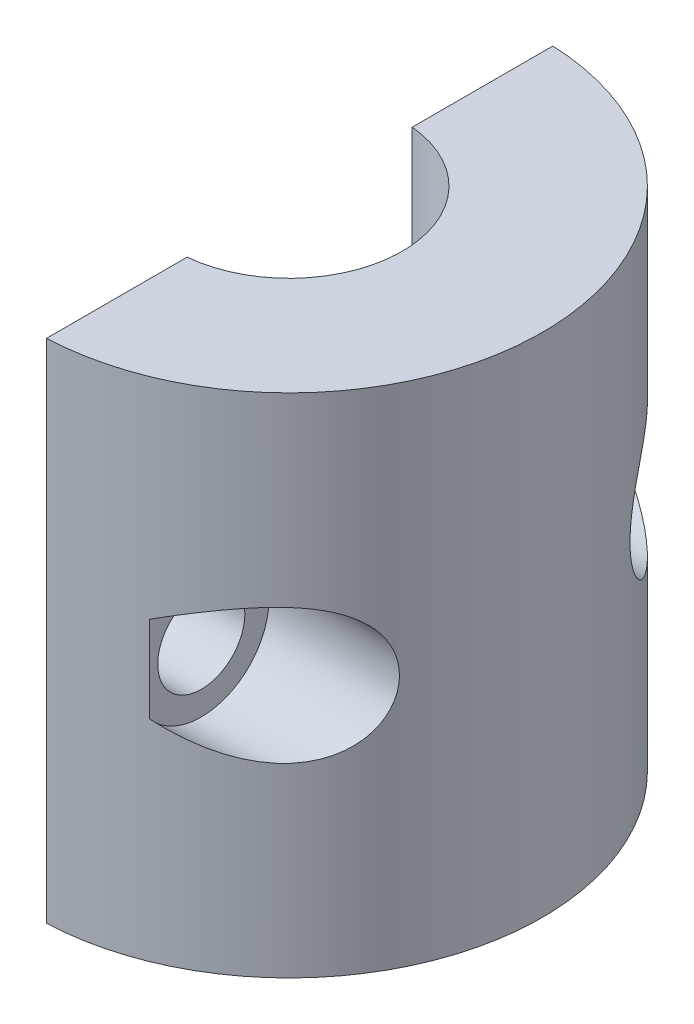
ISO-10303-21;
HEADER;
FILE_DESCRIPTION(('STEP AP214'),'2;1');
FILE_NAME('part.step','',(''),(''),'','','');
FILE_SCHEMA(('AUTOMOTIVE_DESIGN { 1 0 10303 214 1 1 1 1 }'));
ENDSEC;
DATA;
#1=APPLICATION_CONTEXT('core data for automotive mechanical design processes');
#2=APPLICATION_PROTOCOL_DEFINITION('international standard','automotive_design',2000,#1);
#3=PRODUCT_CONTEXT('',#1,'mechanical');
#4=PRODUCT('Part','Part','',(#3));
#5=PRODUCT_RELATED_PRODUCT_CATEGORY('part','',(#4));
#6=PRODUCT_DEFINITION_FORMATION('','',#4);
#7=PRODUCT_DEFINITION_CONTEXT('part definition',#1,'design');
#8=PRODUCT_DEFINITION('design','',#6,#7);
#9=PRODUCT_DEFINITION_SHAPE('','',#8);
#10=(LENGTH_UNIT() NAMED_UNIT(*) SI_UNIT(.MILLI.,.METRE.));
#11=(NAMED_UNIT(*) PLANE_ANGLE_UNIT() SI_UNIT($,.RADIAN.));
#12=(NAMED_UNIT(*) SI_UNIT($,.STERADIAN.) SOLID_ANGLE_UNIT());
#13=UNCERTAINTY_MEASURE_WITH_UNIT(LENGTH_MEASURE(1.E-05),#10,'distance_accuracy_value','');
#14=(GEOMETRIC_REPRESENTATION_CONTEXT(3) GLOBAL_UNCERTAINTY_ASSIGNED_CONTEXT((#13)) GLOBAL_UNIT_ASSIGNED_CONTEXT((#10,
#11,#12)) REPRESENTATION_CONTEXT('',''));
#15=CARTESIAN_POINT('',(0.,0.,0.));
#16=DIRECTION('',(0.,0.,1.));
#17=DIRECTION('',(1.,0.,0.));
#18=AXIS2_PLACEMENT_3D('',#15,#16,#17);
#19=CARTESIAN_POINT('',(0.,19.05,0.));
#20=DIRECTION('',(0.,-1.,0.));
#21=DIRECTION('',(0.,0.,-1.));
#22=AXIS2_PLACEMENT_3D('',#19,#20,#21);
#23=CYLINDRICAL_SURFACE('',#22,9.525);
#24=DIRECTION('',(0.,-1.,0.));
#25=VECTOR('',#24,1.);
#26=CARTESIAN_POINT('',(3.571875,19.05,-8.82991132369827));
#27=LINE('',#26,#25);
#28=CARTESIAN_POINT('',(3.571875,7.90440811715349,-8.82991132369827));
#29=VERTEX_POINT('',#28);
#30=CARTESIAN_POINT('',(3.571875,11.1455918828465,-8.82991132369827));
#31=VERTEX_POINT('',#30);
#32=EDGE_CURVE('E51',#29,#31,#27,.F.);
#33=ORIENTED_EDGE('',*,*,#32,.F.);
#34=CARTESIAN_POINT('',(3.571875,7.9044081171535,-8.82991132369827));
#35=CARTESIAN_POINT('',(3.66209979232473,7.86037056232318,-8.79341345418695));
#36=CARTESIAN_POINT('',(3.7522238570905,7.81744725893768,-8.75534722987873));
#37=CARTESIAN_POINT('',(3.93216628934824,7.73393231878488,-8.67602242601452));
#38=CARTESIAN_POINT('',(4.02198460569287,7.69334105568242,-8.63476333733503));
#39=CARTESIAN_POINT('',(4.2912500306122,7.57503477443256,-8.50590719981016));
#40=CARTESIAN_POINT('',(4.47003426837349,7.50101887483413,-8.41342169051201));
#41=CARTESIAN_POINT('',(4.82699568649797,7.36367012453673,-8.21389744439114));
#42=CARTESIAN_POINT('',(5.00513412907924,7.30049017200264,-8.10668369311737));
#43=CARTESIAN_POINT('',(5.35697382785832,7.18862449653994,-7.8785976275317));
#44=CARTESIAN_POINT('',(5.53068059087369,7.13991989529101,-7.75774338924852));
#45=CARTESIAN_POINT('',(5.79920062410466,7.07736317525379,-7.55710398609687));
#46=CARTESIAN_POINT('',(5.89601696004026,7.05751053906295,-7.48182889904772));
#47=CARTESIAN_POINT('',(6.08736154343368,7.0244521402183,-7.32699075824522));
#48=CARTESIAN_POINT('',(6.18188974558876,7.01124650906621,-7.24742761969324));
#49=CARTESIAN_POINT('',(6.3678760006043,6.99241407341539,-7.08456037835332));
#50=CARTESIAN_POINT('',(6.45934383734736,6.98676029264535,-7.00127069560271));
#51=CARTESIAN_POINT('',(6.63901028383844,6.98393846426453,-6.83114121656956));
#52=CARTESIAN_POINT('',(6.72720959660493,6.98676858102326,-6.74430219225551));
#53=CARTESIAN_POINT('',(6.95163711622552,7.00657082339006,-6.5145459668544));
#54=CARTESIAN_POINT('',(7.08492100436795,7.03101115241624,-6.36925215301089));
#55=CARTESIAN_POINT('',(7.33861669215024,7.10912945487307,-6.07518678831957));
#56=CARTESIAN_POINT('',(7.45904098540909,7.1627787357347,-5.92641878727621));
#57=CARTESIAN_POINT('',(7.66056583113011,7.28886389790973,-5.66242827597344));
#58=CARTESIAN_POINT('',(7.7446651177257,7.35518661747376,-5.54658583071506));
#59=CARTESIAN_POINT('',(7.90093013756525,7.51004718379886,-5.32161775390467));
#60=CARTESIAN_POINT('',(7.97310027730938,7.59857679700967,-5.21248965153888));
#61=CARTESIAN_POINT('',(8.07144112995407,7.74794190059528,-5.05779482070129));
#62=CARTESIAN_POINT('',(8.10267750690789,7.80074562427919,-5.00754025219411));
#63=CARTESIAN_POINT('',(8.16159612794626,7.91161425719849,-4.91092248891653));
#64=CARTESIAN_POINT('',(8.18928012296526,7.96967655027599,-4.86455738100133));
#65=CARTESIAN_POINT('',(8.24098340530796,8.09072710215563,-4.7764456990709));
#66=CARTESIAN_POINT('',(8.26500309791077,8.15371481502928,-4.73469861443373));
#67=CARTESIAN_POINT('',(8.30930198435181,8.28411132903954,-4.65651595251313));
#68=CARTESIAN_POINT('',(8.32958169814648,8.35151951384399,-4.62007963703956));
#69=CARTESIAN_POINT('',(8.38025636503462,8.54263631270502,-4.52785286145473));
#70=CARTESIAN_POINT('',(8.40674170571834,8.67045694811874,-4.47819645802342));
#71=CARTESIAN_POINT('',(8.44796513576629,8.93409256903768,-4.39994283518333));
#72=CARTESIAN_POINT('',(8.46270825963465,9.06990410157538,-4.37133659086811));
#73=CARTESIAN_POINT('',(8.47991385430998,9.3356260314963,-4.33785734701318));
#74=CARTESIAN_POINT('',(8.48315214899674,9.46529869666096,-4.3314855532077));
#75=CARTESIAN_POINT('',(8.47952637859391,9.72393893831676,-4.33858002956364));
#76=CARTESIAN_POINT('',(8.47266434722201,9.85290665150347,-4.35204230610208));
#77=CARTESIAN_POINT('',(8.44900900673009,10.1043421374019,-4.39778463763018));
#78=CARTESIAN_POINT('',(8.43237694537401,10.226881031059,-4.42975904181945));
#79=CARTESIAN_POINT('',(8.38929589942858,10.4643146894415,-4.51081268185751));
#80=CARTESIAN_POINT('',(8.36284699468864,10.5792095163343,-4.55989177857791));
#81=CARTESIAN_POINT('',(8.29963726107557,10.8004904664468,-4.67396543324807));
#82=CARTESIAN_POINT('',(8.26269872086899,10.9066853063611,-4.73923157479821));
#83=CARTESIAN_POINT('',(8.17899572442347,11.1059263800129,-4.88226434844604));
#84=CARTESIAN_POINT('',(8.13222968731193,11.1989704942634,-4.96003299124988));
#85=CARTESIAN_POINT('',(8.02623908029295,11.3757607768071,-5.12988371179305));
#86=CARTESIAN_POINT('',(7.9664274341932,11.4585901155477,-5.22255033256562));
#87=CARTESIAN_POINT('',(7.83723106699825,11.6073065759743,-5.41450179650204));
#88=CARTESIAN_POINT('',(7.7678426566729,11.6731871403843,-5.51378918250957));
#89=CARTESIAN_POINT('',(7.61126450183015,11.7956947343135,-5.72835504562769));
#90=CARTESIAN_POINT('',(7.52293320980239,11.8500914109786,-5.84406561850468));
#91=CARTESIAN_POINT('',(7.33717280398961,11.9394467264164,-6.07565540554215));
#92=CARTESIAN_POINT('',(7.23973823160107,11.9743936140019,-6.1915346793352));
#93=CARTESIAN_POINT('',(7.0588217417664,12.0213893319124,-6.39634448186829));
#94=CARTESIAN_POINT('',(6.97674005478672,12.0367156854936,-6.48579699618851));
#95=CARTESIAN_POINT('',(6.80858689613985,12.0576961598884,-6.66210248826432));
#96=CARTESIAN_POINT('',(6.72251362821212,12.0633458818549,-6.74895426614882));
#97=CARTESIAN_POINT('',(6.54685383824359,12.0660286877278,-6.91949067564383));
#98=CARTESIAN_POINT('',(6.45726059221878,12.0630444018469,-7.00316857919901));
#99=CARTESIAN_POINT('',(6.27522832387629,12.0494182516178,-7.16673706650566));
#100=CARTESIAN_POINT('',(6.18278843201944,12.0387740247957,-7.2466264737071));
#101=CARTESIAN_POINT('',(5.95249626405013,12.0042819148774,-7.43807578984856));
#102=CARTESIAN_POINT('',(5.813288412395,11.9766149278798,-7.54732714778011));
#103=CARTESIAN_POINT('',(5.53090627518268,11.9092738966945,-7.7566509928859));
#104=CARTESIAN_POINT('',(5.3877298926231,11.869593390193,-7.85671850203609));
#105=CARTESIAN_POINT('',(5.09823572691922,11.7801252340329,-8.04758987801269));
#106=CARTESIAN_POINT('',(4.95191528655061,11.7303287080757,-8.13838550335866));
#107=CARTESIAN_POINT('',(4.65705396310569,11.6221993092512,-8.31063300718546));
#108=CARTESIAN_POINT('',(4.5085138955413,11.5638695055627,-8.39208822643472));
#109=CARTESIAN_POINT('',(4.22860225085846,11.4476379035625,-8.53616474207564));
#110=CARTESIAN_POINT('',(4.09742127899583,11.3906051286734,-8.5998662929286));
#111=CARTESIAN_POINT('',(3.83485030637796,11.2716670159615,-8.72010968403709));
#112=CARTESIAN_POINT('',(3.70346412348701,11.2097856043424,-8.77668348281964));
#113=CARTESIAN_POINT('',(3.571875,11.1455918828465,-8.82991132369827));
#114=B_SPLINE_CURVE_WITH_KNOTS('',3,(#34,#35,#36,#37,#38,#39,#40,#41,#42,#43,#44,#45,#46,#47,
#48,#49,#50,#51,#52,#53,#54,#55,#56,#57,#58,#59,#60,#61,#62,#63,#64,#65,#66,#67,#68,#69,#70,#71,
#72,#73,#74,#75,#76,#77,#78,#79,#80,#81,#82,#83,#84,#85,#86,#87,#88,#89,#90,#91,#92,#93,#94,#95,
#96,#97,#98,#99,#100,#101,#102,#103,#104,#105,#106,#107,#108,#109,#110,#111,#112,#113),
.UNSPECIFIED.,.F.,.F.,(4,2,2,2,2,2,2,2,2,2,2,2,2,2,2,2,2,2,2,2,2,2,2,2,2,2,2,2,2,2,2,2,2,2,2,2,
2,2,2,4),(0.,0.320442777941843,0.640936758326895,1.28360142733641,1.93469764712494,
2.58494096255242,2.95741176413708,3.3298899342469,3.70103396956778,4.07209770758108,
4.66586323288177,5.25904653941032,5.73052114953232,6.20182121084317,6.43944778259307,
6.67695677691611,6.914439483198,7.15188914814201,7.56845891322877,7.98484997671861,
8.37256487527391,8.76020171745891,9.14161381594876,9.5230228121315,9.91132432098561,
10.2996883407487,10.7118071721318,11.1240852083429,11.5886045363862,12.0534042142146,
12.4200224963301,12.7868073932551,13.1543306961564,13.5219673989575,14.0584739462024,
14.5952696054324,15.1325383262481,15.6696142796304,16.1391351246827,16.6064696048172),.UNSPECIFIED.);
#115=EDGE_CURVE('E11',#29,#31,#114,.T.);
#116=ORIENTED_EDGE('',*,*,#115,.T.);
#117=EDGE_LOOP('',(#33,#116));
#118=FACE_BOUND('',#117,.T.);
#119=CARTESIAN_POINT('',(0.,0.,0.));
#120=DIRECTION('',(0.,1.,0.));
#121=DIRECTION('',(0.,0.,1.));
#122=AXIS2_PLACEMENT_3D('',#119,#120,#121);
#123=CIRCLE('',#122,9.525);
#124=CARTESIAN_POINT('',(0.396875000000001,0.,9.51672817907368));
#125=VERTEX_POINT('',#124);
#126=CARTESIAN_POINT('',(0.396875000000001,0.,-9.51672817907368));
#127=VERTEX_POINT('',#126);
#128=EDGE_CURVE('E108',#125,#127,#123,.T.);
#129=ORIENTED_EDGE('',*,*,#128,.T.);
#130=DIRECTION('',(0.,-1.,0.));
#131=VECTOR('',#130,1.);
#132=CARTESIAN_POINT('',(0.396875000000001,19.05,-9.51672817907368));
#133=LINE('',#132,#131);
#134=CARTESIAN_POINT('',(0.396875000000001,19.05,-9.51672817907368));
#135=VERTEX_POINT('',#134);
#136=EDGE_CURVE('E162',#135,#127,#133,.T.);
#137=ORIENTED_EDGE('',*,*,#136,.F.);
#138=CARTESIAN_POINT('',(0.,19.05,0.));
#139=DIRECTION('',(0.,1.,0.));
#140=DIRECTION('',(0.,0.,1.));
#141=AXIS2_PLACEMENT_3D('',#138,#139,#140);
#142=CIRCLE('',#141,9.525);
#143=CARTESIAN_POINT('',(0.396875000000001,19.05,9.51672817907368));
#144=VERTEX_POINT('',#143);
#145=EDGE_CURVE('E191',#144,#135,#142,.T.);
#146=ORIENTED_EDGE('',*,*,#145,.F.);
#147=DIRECTION('',(0.,-1.,0.));
#148=VECTOR('',#147,1.);
#149=CARTESIAN_POINT('',(0.396875000000001,19.05,9.51672817907368));
#150=LINE('',#149,#148);
#151=EDGE_CURVE('E186',#144,#125,#150,.T.);
#152=ORIENTED_EDGE('',*,*,#151,.T.);
#153=EDGE_LOOP('',(#129,#137,#146,#152));
#154=FACE_BOUND('',#153,.T.);
#155=CARTESIAN_POINT('',(3.571875,7.9044081171535,8.82991132369827));
#156=CARTESIAN_POINT('',(3.66209979232473,7.86037056232318,8.79341345418695));
#157=CARTESIAN_POINT('',(3.7522238570905,7.81744725893768,8.75534722987873));
#158=CARTESIAN_POINT('',(3.93216628934824,7.73393231878488,8.67602242601452));
#159=CARTESIAN_POINT('',(4.02198460569287,7.69334105568242,8.63476333733503));
#160=CARTESIAN_POINT('',(4.2912500306122,7.57503477443256,8.50590719981016));
#161=CARTESIAN_POINT('',(4.47003426837349,7.50101887483413,8.41342169051201));
#162=CARTESIAN_POINT('',(4.82699568649797,7.36367012453673,8.21389744439114));
#163=CARTESIAN_POINT('',(5.00513412907924,7.30049017200264,8.10668369311737));
#164=CARTESIAN_POINT('',(5.35697382785832,7.18862449653994,7.8785976275317));
#165=CARTESIAN_POINT('',(5.53068059087369,7.13991989529101,7.75774338924852));
#166=CARTESIAN_POINT('',(5.79920062410466,7.07736317525379,7.55710398609687));
#167=CARTESIAN_POINT('',(5.89601696004026,7.05751053906295,7.48182889904772));
#168=CARTESIAN_POINT('',(6.08736154343368,7.0244521402183,7.32699075824522));
#169=CARTESIAN_POINT('',(6.18188974558876,7.01124650906621,7.24742761969324));
#170=CARTESIAN_POINT('',(6.3678760006043,6.99241407341539,7.08456037835332));
#171=CARTESIAN_POINT('',(6.45934383734736,6.98676029264535,7.00127069560271));
#172=CARTESIAN_POINT('',(6.63901028383844,6.98393846426453,6.83114121656956));
#173=CARTESIAN_POINT('',(6.72720959660493,6.98676858102326,6.74430219225551));
#174=CARTESIAN_POINT('',(6.95163711622552,7.00657082339006,6.5145459668544));
#175=CARTESIAN_POINT('',(7.08492100436795,7.03101115241624,6.36925215301089));
#176=CARTESIAN_POINT('',(7.33861669215024,7.10912945487307,6.07518678831957));
#177=CARTESIAN_POINT('',(7.45904098540909,7.1627787357347,5.92641878727621));
#178=CARTESIAN_POINT('',(7.66056583113011,7.28886389790973,5.66242827597344));
#179=CARTESIAN_POINT('',(7.7446651177257,7.35518661747376,5.54658583071506));
#180=CARTESIAN_POINT('',(7.90093013756525,7.51004718379886,5.32161775390467));
#181=CARTESIAN_POINT('',(7.97310027730938,7.59857679700967,5.21248965153888));
#182=CARTESIAN_POINT('',(8.07144112995407,7.74794190059528,5.05779482070129));
#183=CARTESIAN_POINT('',(8.10267750690789,7.80074562427919,5.00754025219411));
#184=CARTESIAN_POINT('',(8.16159612794626,7.91161425719849,4.91092248891653));
#185=CARTESIAN_POINT('',(8.18928012296526,7.96967655027599,4.86455738100133));
#186=CARTESIAN_POINT('',(8.24098340530796,8.09072710215563,4.7764456990709));
#187=CARTESIAN_POINT('',(8.26500309791077,8.15371481502928,4.73469861443373));
#188=CARTESIAN_POINT('',(8.30930198435181,8.28411132903954,4.65651595251313));
#189=CARTESIAN_POINT('',(8.32958169814648,8.35151951384399,4.62007963703956));
#190=CARTESIAN_POINT('',(8.38025636503462,8.54263631270502,4.52785286145473));
#191=CARTESIAN_POINT('',(8.40674170571834,8.67045694811874,4.47819645802342));
#192=CARTESIAN_POINT('',(8.44796513576629,8.93409256903768,4.39994283518333));
#193=CARTESIAN_POINT('',(8.46270825963465,9.06990410157538,4.37133659086811));
#194=CARTESIAN_POINT('',(8.47991385430998,9.3356260314963,4.33785734701318));
#195=CARTESIAN_POINT('',(8.48315214899674,9.46529869666096,4.3314855532077));
#196=CARTESIAN_POINT('',(8.47952637859391,9.72393893831676,4.33858002956364));
#197=CARTESIAN_POINT('',(8.47266434722201,9.85290665150347,4.35204230610208));
#198=CARTESIAN_POINT('',(8.44900900673009,10.1043421374019,4.39778463763018));
#199=CARTESIAN_POINT('',(8.43237694537401,10.226881031059,4.42975904181945));
#200=CARTESIAN_POINT('',(8.38929589942858,10.4643146894415,4.51081268185751));
#201=CARTESIAN_POINT('',(8.36284699468864,10.5792095163343,4.55989177857791));
#202=CARTESIAN_POINT('',(8.29963726107557,10.8004904664468,4.67396543324807));
#203=CARTESIAN_POINT('',(8.26269872086899,10.9066853063611,4.73923157479821));
#204=CARTESIAN_POINT('',(8.17899572442347,11.1059263800129,4.88226434844604));
#205=CARTESIAN_POINT('',(8.13222968731193,11.1989704942634,4.96003299124988));
#206=CARTESIAN_POINT('',(8.02623908029295,11.3757607768071,5.12988371179305));
#207=CARTESIAN_POINT('',(7.9664274341932,11.4585901155477,5.22255033256562));
#208=CARTESIAN_POINT('',(7.83723106699825,11.6073065759743,5.41450179650204));
#209=CARTESIAN_POINT('',(7.7678426566729,11.6731871403843,5.51378918250957));
#210=CARTESIAN_POINT('',(7.61126450183015,11.7956947343135,5.72835504562769));
#211=CARTESIAN_POINT('',(7.52293320980239,11.8500914109786,5.84406561850468));
#212=CARTESIAN_POINT('',(7.33717280398961,11.9394467264164,6.07565540554215));
#213=CARTESIAN_POINT('',(7.23973823160107,11.9743936140019,6.1915346793352));
#214=CARTESIAN_POINT('',(7.0588217417664,12.0213893319124,6.39634448186829));
#215=CARTESIAN_POINT('',(6.97674005478672,12.0367156854936,6.48579699618851));
#216=CARTESIAN_POINT('',(6.80858689613985,12.0576961598884,6.66210248826432));
#217=CARTESIAN_POINT('',(6.72251362821212,12.0633458818549,6.74895426614882));
#218=CARTESIAN_POINT('',(6.54685383824359,12.0660286877278,6.91949067564383));
#219=CARTESIAN_POINT('',(6.45726059221878,12.0630444018469,7.00316857919901));
#220=CARTESIAN_POINT('',(6.27522832387629,12.0494182516178,7.16673706650566));
#221=CARTESIAN_POINT('',(6.18278843201944,12.0387740247957,7.2466264737071));
#222=CARTESIAN_POINT('',(5.95249626405013,12.0042819148774,7.43807578984856));
#223=CARTESIAN_POINT('',(5.813288412395,11.9766149278798,7.54732714778011));
#224=CARTESIAN_POINT('',(5.53090627518268,11.9092738966945,7.7566509928859));
#225=CARTESIAN_POINT('',(5.3877298926231,11.869593390193,7.85671850203609));
#226=CARTESIAN_POINT('',(5.09823572691922,11.7801252340329,8.04758987801269));
#227=CARTESIAN_POINT('',(4.95191528655061,11.7303287080757,8.13838550335866));
#228=CARTESIAN_POINT('',(4.65705396310569,11.6221993092512,8.31063300718546));
#229=CARTESIAN_POINT('',(4.5085138955413,11.5638695055627,8.39208822643472));
#230=CARTESIAN_POINT('',(4.22860225085846,11.4476379035625,8.53616474207564));
#231=CARTESIAN_POINT('',(4.09742127899583,11.3906051286734,8.5998662929286));
#232=CARTESIAN_POINT('',(3.83485030637796,11.2716670159615,8.72010968403709));
#233=CARTESIAN_POINT('',(3.70346412348701,11.2097856043424,8.77668348281964));
#234=CARTESIAN_POINT('',(3.571875,11.1455918828465,8.82991132369827));
#235=B_SPLINE_CURVE_WITH_KNOTS('',3,(#155,#156,#157,#158,#159,#160,#161,#162,#163,#164,#165,
#166,#167,#168,#169,#170,#171,#172,#173,#174,#175,#176,#177,#178,#179,#180,#181,#182,#183,#184,
#185,#186,#187,#188,#189,#190,#191,#192,#193,#194,#195,#196,#197,#198,#199,#200,#201,#202,#203,
#204,#205,#206,#207,#208,#209,#210,#211,#212,#213,#214,#215,#216,#217,#218,#219,#220,#221,#222,
#223,#224,#225,#226,#227,#228,#229,#230,#231,#232,#233,#234),.UNSPECIFIED.,.F.,.F.,(4,2,2,2,2,2,
2,2,2,2,2,2,2,2,2,2,2,2,2,2,2,2,2,2,2,2,2,2,2,2,2,2,2,2,2,2,2,2,2,4),(0.,0.320442777941843,
0.640936758326895,1.28360142733641,1.93469764712494,2.58494096255242,2.95741176413708,
3.3298899342469,3.70103396956778,4.07209770758108,4.66586323288177,5.25904653941032,
5.73052114953232,6.20182121084317,6.43944778259307,6.67695677691611,6.914439483198,
7.15188914814201,7.56845891322877,7.98484997671861,8.37256487527391,8.76020171745891,
9.14161381594876,9.5230228121315,9.91132432098561,10.2996883407487,10.7118071721318,
11.1240852083429,11.5886045363862,12.0534042142146,12.4200224963301,12.7868073932551,
13.1543306961564,13.5219673989575,14.0584739462024,14.5952696054324,15.1325383262481,
15.6696142796304,16.1391351246827,16.6064696048172),.UNSPECIFIED.);
#236=CARTESIAN_POINT('',(3.571875,7.90440811715349,8.82991132369827));
#237=VERTEX_POINT('',#236);
#238=CARTESIAN_POINT('',(3.571875,11.1455918828465,8.82991132369827));
#239=VERTEX_POINT('',#238);
#240=EDGE_CURVE('E97',#237,#239,#235,.T.);
#241=ORIENTED_EDGE('',*,*,#240,.F.);
#242=DIRECTION('',(0.,-1.,0.));
#243=VECTOR('',#242,1.);
#244=CARTESIAN_POINT('',(3.571875,19.05,8.82991132369827));
#245=LINE('',#244,#243);
#246=EDGE_CURVE('E112',#239,#237,#245,.T.);
#247=ORIENTED_EDGE('',*,*,#246,.F.);
#248=EDGE_LOOP('',(#241,#247));
#249=FACE_BOUND('',#248,.T.);
#250=ADVANCED_FACE('F37',(#118,#154,#249),#23,.T.);
#251=CARTESIAN_POINT('',(0.,19.05,0.));
#252=DIRECTION('',(0.,-1.,0.));
#253=DIRECTION('',(0.,0.,-1.));
#254=AXIS2_PLACEMENT_3D('',#251,#252,#253);
#255=CYLINDRICAL_SURFACE('',#254,4.25);
#256=CARTESIAN_POINT('',(0.,0.,0.));
#257=DIRECTION('',(0.,-1.,0.));
#258=DIRECTION('',(0.,0.,1.));
#259=AXIS2_PLACEMENT_3D('',#256,#257,#258);
#260=CIRCLE('',#259,4.25);
#261=CARTESIAN_POINT('',(0.396875000000001,0.,-4.23142886438789));
#262=VERTEX_POINT('',#261);
#263=CARTESIAN_POINT('',(0.396875000000001,0.,4.23142886438789));
#264=VERTEX_POINT('',#263);
#265=EDGE_CURVE('E169',#262,#264,#260,.T.);
#266=ORIENTED_EDGE('',*,*,#265,.T.);
#267=DIRECTION('',(0.,-1.,0.));
#268=VECTOR('',#267,1.);
#269=CARTESIAN_POINT('',(0.396875000000001,19.05,4.23142886438789));
#270=LINE('',#269,#268);
#271=CARTESIAN_POINT('',(0.396875000000001,19.05,4.23142886438789));
#272=VERTEX_POINT('',#271);
#273=EDGE_CURVE('E115',#272,#264,#270,.T.);
#274=ORIENTED_EDGE('',*,*,#273,.F.);
#275=CARTESIAN_POINT('',(0.,19.05,0.));
#276=DIRECTION('',(0.,-1.,0.));
#277=DIRECTION('',(0.,0.,1.));
#278=AXIS2_PLACEMENT_3D('',#275,#276,#277);
#279=CIRCLE('',#278,4.25);
#280=CARTESIAN_POINT('',(0.396875000000001,19.05,-4.23142886438789));
#281=VERTEX_POINT('',#280);
#282=EDGE_CURVE('E164',#281,#272,#279,.T.);
#283=ORIENTED_EDGE('',*,*,#282,.F.);
#284=DIRECTION('',(0.,-1.,0.));
#285=VECTOR('',#284,1.);
#286=CARTESIAN_POINT('',(0.396875000000001,19.05,-4.23142886438789));
#287=LINE('',#286,#285);
#288=EDGE_CURVE('E160',#281,#262,#287,.T.);
#289=ORIENTED_EDGE('',*,*,#288,.T.);
#290=EDGE_LOOP('',(#266,#274,#283,#289));
#291=FACE_BOUND('',#290,.T.);
#292=ADVANCED_FACE('F39',(#291),#255,.F.);
#293=CARTESIAN_POINT('',(0.396875000000001,19.05,4.23142886438789));
#294=DIRECTION('',(1.,0.,0.));
#295=DIRECTION('',(0.,0.,-1.));
#296=AXIS2_PLACEMENT_3D('',#293,#294,#295);
#297=PLANE('',#296);
#298=CARTESIAN_POINT('',(0.396875000000001,9.52500000000001,6.87407852173078));
#299=DIRECTION('',(1.,0.,0.));
#300=DIRECTION('',(0.,0.,-1.));
#301=AXIS2_PLACEMENT_3D('',#298,#299,#300);
#302=CIRCLE('',#301,1.6383);
#303=CARTESIAN_POINT('',(0.396875000000001,9.52500000000001,5.23577852173078));
#304=VERTEX_POINT('',#303);
#305=EDGE_CURVE('E175',#304,#304,#302,.T.);
#306=ORIENTED_EDGE('',*,*,#305,.T.);
#307=EDGE_LOOP('',(#306));
#308=FACE_BOUND('',#307,.T.);
#309=DIRECTION('',(0.,0.,1.));
#310=VECTOR('',#309,1.);
#311=CARTESIAN_POINT('',(0.396875000000001,0.,4.23142886438789));
#312=LINE('',#311,#310);
#313=EDGE_CURVE('E173',#264,#125,#312,.T.);
#314=ORIENTED_EDGE('',*,*,#313,.T.);
#315=ORIENTED_EDGE('',*,*,#151,.F.);
#316=DIRECTION('',(0.,0.,1.));
#317=VECTOR('',#316,1.);
#318=CARTESIAN_POINT('',(0.396875000000001,19.05,4.23142886438789));
#319=LINE('',#318,#317);
#320=EDGE_CURVE('E189',#272,#144,#319,.T.);
#321=ORIENTED_EDGE('',*,*,#320,.F.);
#322=ORIENTED_EDGE('',*,*,#273,.T.);
#323=EDGE_LOOP('',(#314,#315,#321,#322));
#324=FACE_BOUND('',#323,.T.);
#325=ADVANCED_FACE('F145',(#308,#324),#297,.F.);
#326=CARTESIAN_POINT('',(0.396875000000001,19.05,-9.51672817907368));
#327=DIRECTION('',(1.,0.,0.));
#328=DIRECTION('',(0.,0.,-1.));
#329=AXIS2_PLACEMENT_3D('',#326,#327,#328);
#330=PLANE('',#329);
#331=CARTESIAN_POINT('',(0.396875000000001,9.52500000000001,-6.87407852173078));
#332=DIRECTION('',(-1.,0.,0.));
#333=DIRECTION('',(0.,0.,1.));
#334=AXIS2_PLACEMENT_3D('',#331,#332,#333);
#335=CIRCLE('',#334,1.6383);
#336=CARTESIAN_POINT('',(0.396875000000001,9.52500000000001,-5.23577852173078));
#337=VERTEX_POINT('',#336);
#338=EDGE_CURVE('E154',#337,#337,#335,.T.);
#339=ORIENTED_EDGE('',*,*,#338,.F.);
#340=EDGE_LOOP('',(#339));
#341=FACE_BOUND('',#340,.T.);
#342=DIRECTION('',(0.,0.,1.));
#343=VECTOR('',#342,1.);
#344=CARTESIAN_POINT('',(0.396875000000001,0.,-9.51672817907368));
#345=LINE('',#344,#343);
#346=EDGE_CURVE('E157',#127,#262,#345,.T.);
#347=ORIENTED_EDGE('',*,*,#346,.T.);
#348=ORIENTED_EDGE('',*,*,#288,.F.);
#349=DIRECTION('',(0.,0.,1.));
#350=VECTOR('',#349,1.);
#351=CARTESIAN_POINT('',(0.396875000000001,19.05,-9.51672817907368));
#352=LINE('',#351,#350);
#353=EDGE_CURVE('E171',#135,#281,#352,.T.);
#354=ORIENTED_EDGE('',*,*,#353,.F.);
#355=ORIENTED_EDGE('',*,*,#136,.T.);
#356=EDGE_LOOP('',(#347,#348,#354,#355));
#357=FACE_BOUND('',#356,.T.);
#358=ADVANCED_FACE('F140',(#341,#357),#330,.F.);
#359=CARTESIAN_POINT('',(0.,19.05,0.));
#360=DIRECTION('',(0.,1.,0.));
#361=DIRECTION('',(0.,0.,1.));
#362=AXIS2_PLACEMENT_3D('',#359,#360,#361);
#363=PLANE('',#362);
#364=ORIENTED_EDGE('',*,*,#282,.T.);
#365=ORIENTED_EDGE('',*,*,#320,.T.);
#366=ORIENTED_EDGE('',*,*,#145,.T.);
#367=ORIENTED_EDGE('',*,*,#353,.T.);
#368=EDGE_LOOP('',(#364,#365,#366,#367));
#369=FACE_BOUND('',#368,.T.);
#370=ADVANCED_FACE('F137',(#369),#363,.T.);
#371=CARTESIAN_POINT('',(0.,0.,0.));
#372=DIRECTION('',(0.,1.,0.));
#373=DIRECTION('',(0.,0.,1.));
#374=AXIS2_PLACEMENT_3D('',#371,#372,#373);
#375=PLANE('',#374);
#376=ORIENTED_EDGE('',*,*,#265,.F.);
#377=ORIENTED_EDGE('',*,*,#346,.F.);
#378=ORIENTED_EDGE('',*,*,#128,.F.);
#379=ORIENTED_EDGE('',*,*,#313,.F.);
#380=EDGE_LOOP('',(#376,#377,#378,#379));
#381=FACE_BOUND('',#380,.T.);
#382=ADVANCED_FACE('F135',(#381),#375,.F.);
#383=CARTESIAN_POINT('',(0.396875000000001,9.52500000000001,6.87407852173078));
#384=DIRECTION('',(1.,0.,0.));
#385=DIRECTION('',(0.,0.,-1.));
#386=AXIS2_PLACEMENT_3D('',#383,#384,#385);
#387=CYLINDRICAL_SURFACE('',#386,1.6383);
#388=ORIENTED_EDGE('',*,*,#305,.F.);
#389=EDGE_LOOP('',(#388));
#390=FACE_BOUND('',#389,.T.);
#391=CARTESIAN_POINT('',(3.571875,9.52500000000001,6.87407852173078));
#392=DIRECTION('',(1.,0.,0.));
#393=DIRECTION('',(0.,0.,-1.));
#394=AXIS2_PLACEMENT_3D('',#391,#392,#393);
#395=CIRCLE('',#394,1.6383);
#396=CARTESIAN_POINT('',(3.571875,9.52500000000001,5.23577852173078));
#397=VERTEX_POINT('',#396);
#398=EDGE_CURVE('E179',#397,#397,#395,.T.);
#399=ORIENTED_EDGE('',*,*,#398,.T.);
#400=EDGE_LOOP('',(#399));
#401=FACE_BOUND('',#400,.T.);
#402=ADVANCED_FACE('F131',(#390,#401),#387,.F.);
#403=CARTESIAN_POINT('',(9.525,9.52500000000001,6.87407852173078));
#404=DIRECTION('',(-1.,0.,0.));
#405=DIRECTION('',(0.,0.,1.));
#406=AXIS2_PLACEMENT_3D('',#403,#404,#405);
#407=CYLINDRICAL_SURFACE('',#406,2.54);
#408=ORIENTED_EDGE('',*,*,#240,.T.);
#409=CARTESIAN_POINT('',(3.571875,9.52500000000001,6.87407852173078));
#410=DIRECTION('',(1.,0.,0.));
#411=DIRECTION('',(0.,0.,-1.));
#412=AXIS2_PLACEMENT_3D('',#409,#410,#411);
#413=CIRCLE('',#412,2.54);
#414=EDGE_CURVE('E64',#237,#239,#413,.T.);
#415=ORIENTED_EDGE('',*,*,#414,.F.);
#416=EDGE_LOOP('',(#408,#415));
#417=FACE_BOUND('',#416,.T.);
#418=ADVANCED_FACE('F125',(#417),#407,.F.);
#419=CARTESIAN_POINT('',(3.571875,9.52500000000001,6.87407852173078));
#420=DIRECTION('',(1.,0.,0.));
#421=DIRECTION('',(0.,0.,-1.));
#422=AXIS2_PLACEMENT_3D('',#419,#420,#421);
#423=PLANE('',#422);
#424=ORIENTED_EDGE('',*,*,#398,.F.);
#425=EDGE_LOOP('',(#424));
#426=FACE_BOUND('',#425,.T.);
#427=ORIENTED_EDGE('',*,*,#246,.T.);
#428=ORIENTED_EDGE('',*,*,#414,.T.);
#429=EDGE_LOOP('',(#427,#428));
#430=FACE_BOUND('',#429,.T.);
#431=ADVANCED_FACE('F130',(#426,#430),#423,.T.);
#432=CARTESIAN_POINT('',(0.396875000000001,9.52500000000001,-6.87407852173078));
#433=DIRECTION('',(1.,0.,0.));
#434=DIRECTION('',(0.,0.,-1.));
#435=AXIS2_PLACEMENT_3D('',#432,#433,#434);
#436=CYLINDRICAL_SURFACE('',#435,1.6383);
#437=ORIENTED_EDGE('',*,*,#338,.T.);
#438=EDGE_LOOP('',(#437));
#439=FACE_BOUND('',#438,.T.);
#440=CARTESIAN_POINT('',(3.571875,9.52500000000001,-6.87407852173078));
#441=DIRECTION('',(-1.,0.,0.));
#442=DIRECTION('',(0.,0.,1.));
#443=AXIS2_PLACEMENT_3D('',#440,#441,#442);
#444=CIRCLE('',#443,1.6383);
#445=CARTESIAN_POINT('',(3.571875,9.52500000000001,-5.23577852173078));
#446=VERTEX_POINT('',#445);
#447=EDGE_CURVE('E100',#446,#446,#444,.T.);
#448=ORIENTED_EDGE('',*,*,#447,.F.);
#449=EDGE_LOOP('',(#448));
#450=FACE_BOUND('',#449,.T.);
#451=ADVANCED_FACE('F201',(#439,#450),#436,.F.);
#452=CARTESIAN_POINT('',(9.525,9.52500000000001,-6.87407852173078));
#453=DIRECTION('',(-1.,0.,0.));
#454=DIRECTION('',(0.,0.,1.));
#455=AXIS2_PLACEMENT_3D('',#452,#453,#454);
#456=CYLINDRICAL_SURFACE('',#455,2.54);
#457=CARTESIAN_POINT('',(3.571875,9.52500000000001,-6.87407852173078));
#458=DIRECTION('',(-1.,0.,0.));
#459=DIRECTION('',(0.,0.,1.));
#460=AXIS2_PLACEMENT_3D('',#457,#458,#459);
#461=CIRCLE('',#460,2.54);
#462=EDGE_CURVE('E57',#29,#31,#461,.T.);
#463=ORIENTED_EDGE('',*,*,#462,.T.);
#464=ORIENTED_EDGE('',*,*,#115,.F.);
#465=EDGE_LOOP('',(#463,#464));
#466=FACE_BOUND('',#465,.T.);
#467=ADVANCED_FACE('F99',(#466),#456,.F.);
#468=CARTESIAN_POINT('',(3.571875,9.52500000000001,-6.87407852173078));
#469=DIRECTION('',(1.,0.,0.));
#470=DIRECTION('',(0.,0.,1.));
#471=AXIS2_PLACEMENT_3D('',#468,#469,#470);
#472=PLANE('',#471);
#473=ORIENTED_EDGE('',*,*,#32,.T.);
#474=ORIENTED_EDGE('',*,*,#462,.F.);
#475=EDGE_LOOP('',(#473,#474));
#476=FACE_BOUND('',#475,.T.);
#477=ORIENTED_EDGE('',*,*,#447,.T.);
#478=EDGE_LOOP('',(#477));
#479=FACE_BOUND('',#478,.T.);
#480=ADVANCED_FACE('F94',(#476,#479),#472,.T.);
#481=CLOSED_SHELL('',(#250,#292,#325,#358,#370,#382,#402,#418,#431,#451,#467,#480));
#482=MANIFOLD_SOLID_BREP('B2',#481);
#483=ADVANCED_BREP_SHAPE_REPRESENTATION('',(#18,#482),#14);
#484=SHAPE_DEFINITION_REPRESENTATION(#9,#483);
ENDSEC;
END-ISO-10303-21;
